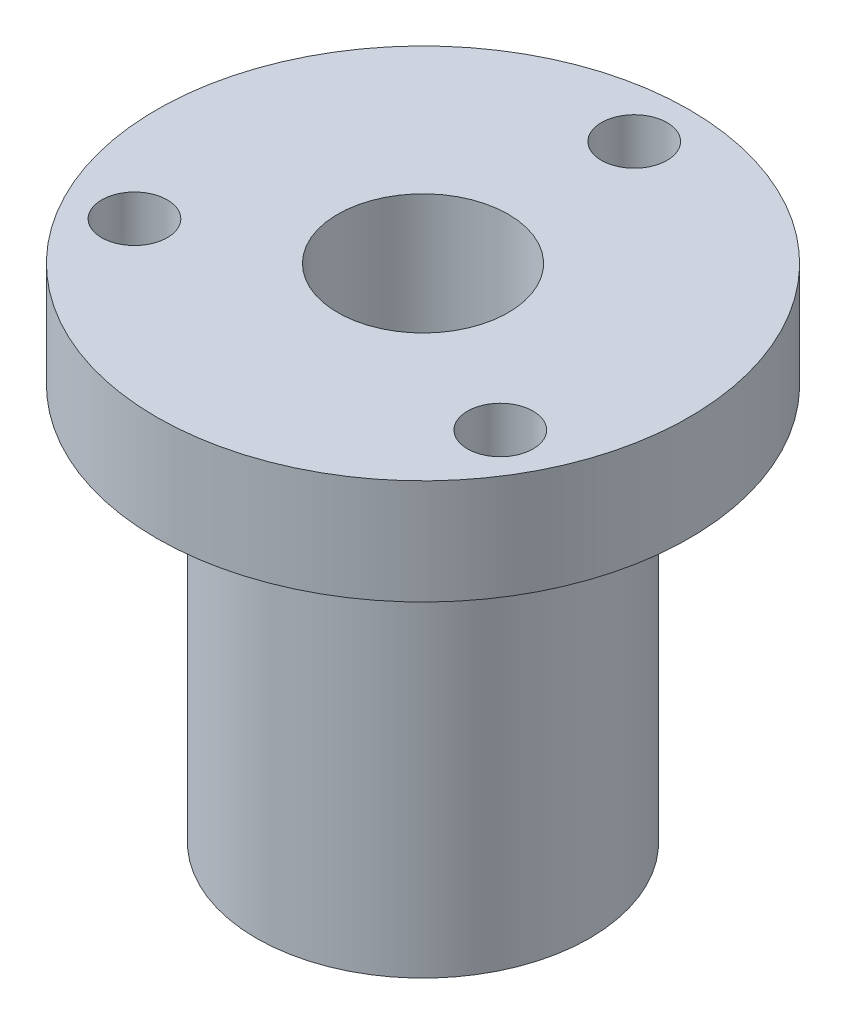
ISO-10303-21;
HEADER;
FILE_DESCRIPTION(('STEP AP214'),'2;1');
FILE_NAME('part.step','',(''),(''),'','','');
FILE_SCHEMA(('AUTOMOTIVE_DESIGN { 1 0 10303 214 1 1 1 1 }'));
ENDSEC;
DATA;
#1=APPLICATION_CONTEXT('core data for automotive mechanical design processes');
#2=APPLICATION_PROTOCOL_DEFINITION('international standard','automotive_design',2000,#1);
#3=PRODUCT_CONTEXT('',#1,'mechanical');
#4=PRODUCT('Part','Part','',(#3));
#5=PRODUCT_RELATED_PRODUCT_CATEGORY('part','',(#4));
#6=PRODUCT_DEFINITION_FORMATION('','',#4);
#7=PRODUCT_DEFINITION_CONTEXT('part definition',#1,'design');
#8=PRODUCT_DEFINITION('design','',#6,#7);
#9=PRODUCT_DEFINITION_SHAPE('','',#8);
#10=(LENGTH_UNIT() NAMED_UNIT(*) SI_UNIT(.MILLI.,.METRE.));
#11=(NAMED_UNIT(*) PLANE_ANGLE_UNIT() SI_UNIT($,.RADIAN.));
#12=(NAMED_UNIT(*) SI_UNIT($,.STERADIAN.) SOLID_ANGLE_UNIT());
#13=UNCERTAINTY_MEASURE_WITH_UNIT(LENGTH_MEASURE(1.E-05),#10,'distance_accuracy_value','');
#14=(GEOMETRIC_REPRESENTATION_CONTEXT(3) GLOBAL_UNCERTAINTY_ASSIGNED_CONTEXT((#13)) GLOBAL_UNIT_ASSIGNED_CONTEXT((#10,
#11,#12)) REPRESENTATION_CONTEXT('',''));
#15=CARTESIAN_POINT('',(0.,0.,0.));
#16=DIRECTION('',(0.,0.,1.));
#17=DIRECTION('',(1.,0.,0.));
#18=AXIS2_PLACEMENT_3D('',#15,#16,#17);
#19=CARTESIAN_POINT('',(3.25,0.,0.));
#20=DIRECTION('',(0.,-1.,0.));
#21=DIRECTION('',(0.,0.,-1.));
#22=AXIS2_PLACEMENT_3D('',#19,#20,#21);
#23=PLANE('',#22);
#24=CARTESIAN_POINT('',(0.,0.,0.));
#25=DIRECTION('',(0.,-1.,0.));
#26=DIRECTION('',(0.,0.,-1.));
#27=AXIS2_PLACEMENT_3D('',#24,#25,#26);
#28=CIRCLE('',#27,6.35);
#29=CARTESIAN_POINT('',(0.,0.,-6.35));
#30=VERTEX_POINT('',#29);
#31=EDGE_CURVE('E10',#30,#30,#28,.T.);
#32=ORIENTED_EDGE('',*,*,#31,.T.);
#33=EDGE_LOOP('',(#32));
#34=FACE_BOUND('',#33,.T.);
#35=CARTESIAN_POINT('',(0.,0.,0.));
#36=DIRECTION('',(0.,-1.,0.));
#37=DIRECTION('',(0.,0.,-1.));
#38=AXIS2_PLACEMENT_3D('',#35,#36,#37);
#39=CIRCLE('',#38,3.25);
#40=CARTESIAN_POINT('',(0.,0.,-3.25));
#41=VERTEX_POINT('',#40);
#42=EDGE_CURVE('E66',#41,#41,#39,.T.);
#43=ORIENTED_EDGE('',*,*,#42,.F.);
#44=EDGE_LOOP('',(#43));
#45=FACE_BOUND('',#44,.T.);
#46=ADVANCED_FACE('F39',(#34,#45),#23,.T.);
#47=CARTESIAN_POINT('',(0.,0.,0.));
#48=DIRECTION('',(0.,-1.,0.));
#49=DIRECTION('',(0.,0.,-1.));
#50=AXIS2_PLACEMENT_3D('',#47,#48,#49);
#51=CYLINDRICAL_SURFACE('',#50,6.35);
#52=CARTESIAN_POINT('',(0.,15.1,0.));
#53=DIRECTION('',(0.,-1.,0.));
#54=DIRECTION('',(0.,0.,-1.));
#55=AXIS2_PLACEMENT_3D('',#52,#53,#54);
#56=CIRCLE('',#55,6.35);
#57=CARTESIAN_POINT('',(0.,15.1,-6.35));
#58=VERTEX_POINT('',#57);
#59=EDGE_CURVE('E46',#58,#58,#56,.T.);
#60=ORIENTED_EDGE('',*,*,#59,.T.);
#61=EDGE_LOOP('',(#60));
#62=FACE_BOUND('',#61,.T.);
#63=ORIENTED_EDGE('',*,*,#31,.F.);
#64=EDGE_LOOP('',(#63));
#65=FACE_BOUND('',#64,.T.);
#66=ADVANCED_FACE('F119',(#62,#65),#51,.T.);
#67=CARTESIAN_POINT('',(6.35,15.1,0.));
#68=DIRECTION('',(0.,-1.,0.));
#69=DIRECTION('',(0.,0.,-1.));
#70=AXIS2_PLACEMENT_3D('',#67,#68,#69);
#71=PLANE('',#70);
#72=CARTESIAN_POINT('',(-6.97150450046471,15.1,4.02500000000004));
#73=DIRECTION('',(0.,-1.,0.));
#74=DIRECTION('',(0.,0.,-1.));
#75=AXIS2_PLACEMENT_3D('',#72,#73,#74);
#76=CIRCLE('',#75,1.25);
#77=CARTESIAN_POINT('',(-6.97150450046471,15.1,2.77500000000004));
#78=VERTEX_POINT('',#77);
#79=EDGE_CURVE('E87',#78,#78,#76,.F.);
#80=ORIENTED_EDGE('',*,*,#79,.T.);
#81=EDGE_LOOP('',(#80));
#82=FACE_BOUND('',#81,.T.);
#83=CARTESIAN_POINT('',(6.97150450046474,15.1,4.02499999999998));
#84=DIRECTION('',(0.,-1.,0.));
#85=DIRECTION('',(0.,0.,-1.));
#86=AXIS2_PLACEMENT_3D('',#83,#84,#85);
#87=CIRCLE('',#86,1.25);
#88=CARTESIAN_POINT('',(6.97150450046474,15.1,2.77499999999999));
#89=VERTEX_POINT('',#88);
#90=EDGE_CURVE('E79',#89,#89,#87,.F.);
#91=ORIENTED_EDGE('',*,*,#90,.T.);
#92=EDGE_LOOP('',(#91));
#93=FACE_BOUND('',#92,.T.);
#94=CARTESIAN_POINT('',(0.,15.1,-8.05));
#95=DIRECTION('',(0.,-1.,0.));
#96=DIRECTION('',(0.,0.,-1.));
#97=AXIS2_PLACEMENT_3D('',#94,#95,#96);
#98=CIRCLE('',#97,1.25);
#99=CARTESIAN_POINT('',(0.,15.1,-9.3));
#100=VERTEX_POINT('',#99);
#101=EDGE_CURVE('E71',#100,#100,#98,.F.);
#102=ORIENTED_EDGE('',*,*,#101,.T.);
#103=EDGE_LOOP('',(#102));
#104=FACE_BOUND('',#103,.T.);
#105=CARTESIAN_POINT('',(0.,15.1,0.));
#106=DIRECTION('',(0.,-1.,0.));
#107=DIRECTION('',(0.,0.,-1.));
#108=AXIS2_PLACEMENT_3D('',#105,#106,#107);
#109=CIRCLE('',#108,10.15);
#110=CARTESIAN_POINT('',(0.,15.1,-10.15));
#111=VERTEX_POINT('',#110);
#112=EDGE_CURVE('E51',#111,#111,#109,.T.);
#113=ORIENTED_EDGE('',*,*,#112,.T.);
#114=EDGE_LOOP('',(#113));
#115=FACE_BOUND('',#114,.T.);
#116=ORIENTED_EDGE('',*,*,#59,.F.);
#117=EDGE_LOOP('',(#116));
#118=FACE_BOUND('',#117,.T.);
#119=ADVANCED_FACE('F113',(#82,#93,#104,#115,#118),#71,.T.);
#120=CARTESIAN_POINT('',(0.,0.,0.));
#121=DIRECTION('',(0.,-1.,0.));
#122=DIRECTION('',(0.,0.,-1.));
#123=AXIS2_PLACEMENT_3D('',#120,#121,#122);
#124=CYLINDRICAL_SURFACE('',#123,10.15);
#125=CARTESIAN_POINT('',(0.,19.1,0.));
#126=DIRECTION('',(0.,-1.,0.));
#127=DIRECTION('',(0.,0.,-1.));
#128=AXIS2_PLACEMENT_3D('',#125,#126,#127);
#129=CIRCLE('',#128,10.15);
#130=CARTESIAN_POINT('',(0.,19.1,-10.15));
#131=VERTEX_POINT('',#130);
#132=EDGE_CURVE('E56',#131,#131,#129,.T.);
#133=ORIENTED_EDGE('',*,*,#132,.T.);
#134=EDGE_LOOP('',(#133));
#135=FACE_BOUND('',#134,.T.);
#136=ORIENTED_EDGE('',*,*,#112,.F.);
#137=EDGE_LOOP('',(#136));
#138=FACE_BOUND('',#137,.T.);
#139=ADVANCED_FACE('F101',(#135,#138),#124,.T.);
#140=CARTESIAN_POINT('',(10.15,19.1,0.));
#141=DIRECTION('',(0.,1.,0.));
#142=DIRECTION('',(0.,0.,1.));
#143=AXIS2_PLACEMENT_3D('',#140,#141,#142);
#144=PLANE('',#143);
#145=CARTESIAN_POINT('',(-6.97150450046471,19.1,4.02500000000004));
#146=DIRECTION('',(0.,1.,0.));
#147=DIRECTION('',(0.,0.,1.));
#148=AXIS2_PLACEMENT_3D('',#145,#146,#147);
#149=CIRCLE('',#148,1.25);
#150=CARTESIAN_POINT('',(-6.97150450046471,19.1,5.27500000000004));
#151=VERTEX_POINT('',#150);
#152=EDGE_CURVE('E83',#151,#151,#149,.T.);
#153=ORIENTED_EDGE('',*,*,#152,.F.);
#154=EDGE_LOOP('',(#153));
#155=FACE_BOUND('',#154,.T.);
#156=CARTESIAN_POINT('',(6.97150450046474,19.1,4.02499999999998));
#157=DIRECTION('',(0.,1.,0.));
#158=DIRECTION('',(0.,0.,1.));
#159=AXIS2_PLACEMENT_3D('',#156,#157,#158);
#160=CIRCLE('',#159,1.25);
#161=CARTESIAN_POINT('',(6.97150450046474,19.1,5.27499999999998));
#162=VERTEX_POINT('',#161);
#163=EDGE_CURVE('E75',#162,#162,#160,.T.);
#164=ORIENTED_EDGE('',*,*,#163,.F.);
#165=EDGE_LOOP('',(#164));
#166=FACE_BOUND('',#165,.T.);
#167=CARTESIAN_POINT('',(0.,19.1,-8.05));
#168=DIRECTION('',(0.,1.,0.));
#169=DIRECTION('',(0.,0.,1.));
#170=AXIS2_PLACEMENT_3D('',#167,#168,#169);
#171=CIRCLE('',#170,1.25);
#172=CARTESIAN_POINT('',(0.,19.1,-6.8));
#173=VERTEX_POINT('',#172);
#174=EDGE_CURVE('E70',#173,#173,#171,.T.);
#175=ORIENTED_EDGE('',*,*,#174,.F.);
#176=EDGE_LOOP('',(#175));
#177=FACE_BOUND('',#176,.T.);
#178=CARTESIAN_POINT('',(0.,19.1,0.));
#179=DIRECTION('',(0.,-1.,0.));
#180=DIRECTION('',(0.,0.,-1.));
#181=AXIS2_PLACEMENT_3D('',#178,#179,#180);
#182=CIRCLE('',#181,3.25);
#183=CARTESIAN_POINT('',(0.,19.1,-3.25));
#184=VERTEX_POINT('',#183);
#185=EDGE_CURVE('E62',#184,#184,#182,.T.);
#186=ORIENTED_EDGE('',*,*,#185,.T.);
#187=EDGE_LOOP('',(#186));
#188=FACE_BOUND('',#187,.T.);
#189=ORIENTED_EDGE('',*,*,#132,.F.);
#190=EDGE_LOOP('',(#189));
#191=FACE_BOUND('',#190,.T.);
#192=ADVANCED_FACE('F97',(#155,#166,#177,#188,#191),#144,.T.);
#193=CARTESIAN_POINT('',(0.,0.,0.));
#194=DIRECTION('',(0.,-1.,0.));
#195=DIRECTION('',(0.,0.,-1.));
#196=AXIS2_PLACEMENT_3D('',#193,#194,#195);
#197=CYLINDRICAL_SURFACE('',#196,3.25);
#198=ORIENTED_EDGE('',*,*,#42,.T.);
#199=EDGE_LOOP('',(#198));
#200=FACE_BOUND('',#199,.T.);
#201=ORIENTED_EDGE('',*,*,#185,.F.);
#202=EDGE_LOOP('',(#201));
#203=FACE_BOUND('',#202,.T.);
#204=ADVANCED_FACE('F100',(#200,#203),#197,.F.);
#205=CARTESIAN_POINT('',(0.,-0.001000000000001,-8.05));
#206=DIRECTION('',(0.,1.,0.));
#207=DIRECTION('',(0.,0.,1.));
#208=AXIS2_PLACEMENT_3D('',#205,#206,#207);
#209=CYLINDRICAL_SURFACE('',#208,1.25);
#210=ORIENTED_EDGE('',*,*,#101,.F.);
#211=EDGE_LOOP('',(#210));
#212=FACE_BOUND('',#211,.T.);
#213=ORIENTED_EDGE('',*,*,#174,.T.);
#214=EDGE_LOOP('',(#213));
#215=FACE_BOUND('',#214,.T.);
#216=ADVANCED_FACE('F134',(#212,#215),#209,.F.);
#217=CARTESIAN_POINT('',(6.97150450046474,-0.001000000000001,4.02499999999998));
#218=DIRECTION('',(0.,1.,0.));
#219=DIRECTION('',(0.,0.,1.));
#220=AXIS2_PLACEMENT_3D('',#217,#218,#219);
#221=CYLINDRICAL_SURFACE('',#220,1.25);
#222=ORIENTED_EDGE('',*,*,#90,.F.);
#223=EDGE_LOOP('',(#222));
#224=FACE_BOUND('',#223,.T.);
#225=ORIENTED_EDGE('',*,*,#163,.T.);
#226=EDGE_LOOP('',(#225));
#227=FACE_BOUND('',#226,.T.);
#228=ADVANCED_FACE('F139',(#224,#227),#221,.F.);
#229=CARTESIAN_POINT('',(-6.97150450046471,-0.001000000000001,4.02500000000004));
#230=DIRECTION('',(0.,1.,0.));
#231=DIRECTION('',(0.,0.,1.));
#232=AXIS2_PLACEMENT_3D('',#229,#230,#231);
#233=CYLINDRICAL_SURFACE('',#232,1.25);
#234=ORIENTED_EDGE('',*,*,#79,.F.);
#235=EDGE_LOOP('',(#234));
#236=FACE_BOUND('',#235,.T.);
#237=ORIENTED_EDGE('',*,*,#152,.T.);
#238=EDGE_LOOP('',(#237));
#239=FACE_BOUND('',#238,.T.);
#240=ADVANCED_FACE('F95',(#236,#239),#233,.F.);
#241=CLOSED_SHELL('',(#46,#66,#119,#139,#192,#204,#216,#228,#240));
#242=MANIFOLD_SOLID_BREP('B2',#241);
#243=ADVANCED_BREP_SHAPE_REPRESENTATION('',(#18,#242),#14);
#244=SHAPE_DEFINITION_REPRESENTATION(#9,#243);
ENDSEC;
END-ISO-10303-21;
